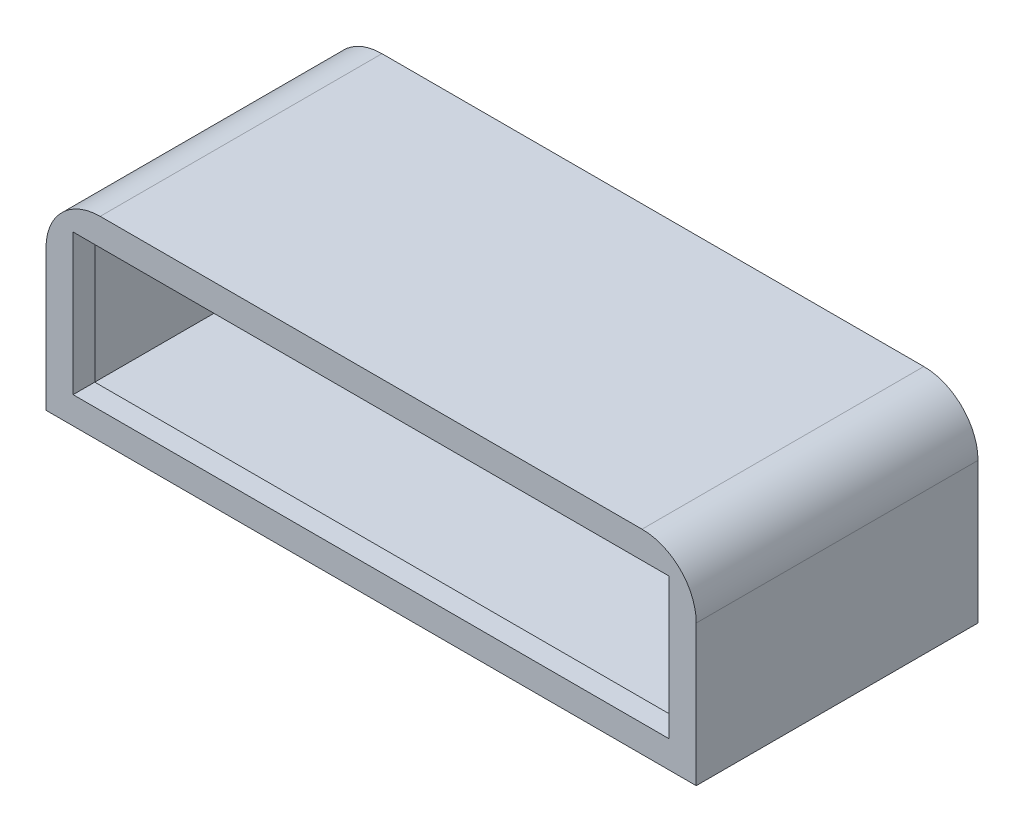
ISO-10303-21;
HEADER;
FILE_DESCRIPTION(('STEP AP214'),'2;1');
FILE_NAME('part.step','',(''),(''),'','','');
FILE_SCHEMA(('AUTOMOTIVE_DESIGN { 1 0 10303 214 1 1 1 1 }'));
ENDSEC;
DATA;
#1=APPLICATION_CONTEXT('core data for automotive mechanical design processes');
#2=APPLICATION_PROTOCOL_DEFINITION('international standard','automotive_design',2000,#1);
#3=PRODUCT_CONTEXT('',#1,'mechanical');
#4=PRODUCT('Part','Part','',(#3));
#5=PRODUCT_RELATED_PRODUCT_CATEGORY('part','',(#4));
#6=PRODUCT_DEFINITION_FORMATION('','',#4);
#7=PRODUCT_DEFINITION_CONTEXT('part definition',#1,'design');
#8=PRODUCT_DEFINITION('design','',#6,#7);
#9=PRODUCT_DEFINITION_SHAPE('','',#8);
#10=(LENGTH_UNIT() NAMED_UNIT(*) SI_UNIT(.MILLI.,.METRE.));
#11=(NAMED_UNIT(*) PLANE_ANGLE_UNIT() SI_UNIT($,.RADIAN.));
#12=(NAMED_UNIT(*) SI_UNIT($,.STERADIAN.) SOLID_ANGLE_UNIT());
#13=UNCERTAINTY_MEASURE_WITH_UNIT(LENGTH_MEASURE(1.E-05),#10,'distance_accuracy_value','');
#14=(GEOMETRIC_REPRESENTATION_CONTEXT(3) GLOBAL_UNCERTAINTY_ASSIGNED_CONTEXT((#13)) GLOBAL_UNIT_ASSIGNED_CONTEXT((#10,
#11,#12)) REPRESENTATION_CONTEXT('',''));
#15=CARTESIAN_POINT('',(0.,0.,0.));
#16=DIRECTION('',(0.,0.,1.));
#17=DIRECTION('',(1.,0.,0.));
#18=AXIS2_PLACEMENT_3D('',#15,#16,#17);
#19=CARTESIAN_POINT('',(0.,0.,0.));
#20=DIRECTION('',(0.,0.,-1.));
#21=DIRECTION('',(-1.,0.,0.));
#22=AXIS2_PLACEMENT_3D('',#19,#20,#21);
#23=PLANE('',#22);
#24=CARTESIAN_POINT('',(-57.15,-20.32,0.));
#25=DIRECTION('',(0.,0.,-1.));
#26=DIRECTION('',(1.,0.,0.));
#27=AXIS2_PLACEMENT_3D('',#24,#25,#26);
#28=CIRCLE('',#27,0.999999999999998);
#29=CARTESIAN_POINT('',(-56.15,-20.32,0.));
#30=VERTEX_POINT('',#29);
#31=EDGE_CURVE('E473',#30,#30,#28,.T.);
#32=ORIENTED_EDGE('',*,*,#31,.F.);
#33=EDGE_LOOP('',(#32));
#34=FACE_BOUND('',#33,.T.);
#35=CARTESIAN_POINT('',(-57.15,20.32,0.));
#36=DIRECTION('',(0.,0.,-1.));
#37=DIRECTION('',(-1.,0.,0.));
#38=AXIS2_PLACEMENT_3D('',#35,#36,#37);
#39=CIRCLE('',#38,0.999999999999998);
#40=CARTESIAN_POINT('',(-58.15,20.32,0.));
#41=VERTEX_POINT('',#40);
#42=EDGE_CURVE('E472',#41,#41,#39,.T.);
#43=ORIENTED_EDGE('',*,*,#42,.F.);
#44=EDGE_LOOP('',(#43));
#45=FACE_BOUND('',#44,.T.);
#46=CARTESIAN_POINT('',(57.15,20.32,0.));
#47=DIRECTION('',(0.,0.,-1.));
#48=DIRECTION('',(1.,0.,0.));
#49=AXIS2_PLACEMENT_3D('',#46,#47,#48);
#50=CIRCLE('',#49,0.999999999999998);
#51=CARTESIAN_POINT('',(58.15,20.32,0.));
#52=VERTEX_POINT('',#51);
#53=EDGE_CURVE('E504',#52,#52,#50,.T.);
#54=ORIENTED_EDGE('',*,*,#53,.F.);
#55=EDGE_LOOP('',(#54));
#56=FACE_BOUND('',#55,.T.);
#57=CARTESIAN_POINT('',(57.15,-20.32,0.));
#58=DIRECTION('',(0.,0.,-1.));
#59=DIRECTION('',(-1.,0.,0.));
#60=AXIS2_PLACEMENT_3D('',#57,#58,#59);
#61=CIRCLE('',#60,0.999999999999998);
#62=CARTESIAN_POINT('',(56.15,-20.32,0.));
#63=VERTEX_POINT('',#62);
#64=EDGE_CURVE('E485',#63,#63,#61,.T.);
#65=ORIENTED_EDGE('',*,*,#64,.F.);
#66=EDGE_LOOP('',(#65));
#67=FACE_BOUND('',#66,.T.);
#68=DIRECTION('',(-1.,0.,0.));
#69=VECTOR('',#68,1.);
#70=CARTESIAN_POINT('',(-76.2,22.86,0.));
#71=LINE('',#70,#69);
#72=CARTESIAN_POINT('',(63.5,22.86,0.));
#73=VERTEX_POINT('',#72);
#74=CARTESIAN_POINT('',(-63.5,22.86,0.));
#75=VERTEX_POINT('',#74);
#76=EDGE_CURVE('E216',#73,#75,#71,.T.);
#77=ORIENTED_EDGE('',*,*,#76,.F.);
#78=CARTESIAN_POINT('',(63.5,10.16,0.));
#79=DIRECTION('',(0.,0.,-1.));
#80=DIRECTION('',(-1.,0.,0.));
#81=AXIS2_PLACEMENT_3D('',#78,#79,#80);
#82=CIRCLE('',#81,12.7);
#83=CARTESIAN_POINT('',(76.2,10.16,0.));
#84=VERTEX_POINT('',#83);
#85=EDGE_CURVE('E241',#73,#84,#82,.T.);
#86=ORIENTED_EDGE('',*,*,#85,.T.);
#87=DIRECTION('',(0.,1.,0.));
#88=VECTOR('',#87,1.);
#89=CARTESIAN_POINT('',(76.2,-22.86,0.));
#90=LINE('',#89,#88);
#91=CARTESIAN_POINT('',(76.2,-22.86,0.));
#92=VERTEX_POINT('',#91);
#93=EDGE_CURVE('E177',#92,#84,#90,.T.);
#94=ORIENTED_EDGE('',*,*,#93,.F.);
#95=DIRECTION('',(1.,0.,0.));
#96=VECTOR('',#95,1.);
#97=CARTESIAN_POINT('',(-76.2,-22.86,0.));
#98=LINE('',#97,#96);
#99=CARTESIAN_POINT('',(-76.2,-22.86,0.));
#100=VERTEX_POINT('',#99);
#101=EDGE_CURVE('E208',#100,#92,#98,.T.);
#102=ORIENTED_EDGE('',*,*,#101,.F.);
#103=DIRECTION('',(0.,-1.,0.));
#104=VECTOR('',#103,1.);
#105=CARTESIAN_POINT('',(-76.2,-22.86,0.));
#106=LINE('',#105,#104);
#107=CARTESIAN_POINT('',(-76.2,10.16,0.));
#108=VERTEX_POINT('',#107);
#109=EDGE_CURVE('E219',#108,#100,#106,.T.);
#110=ORIENTED_EDGE('',*,*,#109,.F.);
#111=CARTESIAN_POINT('',(-63.5,10.16,0.));
#112=DIRECTION('',(0.,0.,-1.));
#113=DIRECTION('',(-1.,0.,0.));
#114=AXIS2_PLACEMENT_3D('',#111,#112,#113);
#115=CIRCLE('',#114,12.7);
#116=EDGE_CURVE('E239',#108,#75,#115,.T.);
#117=ORIENTED_EDGE('',*,*,#116,.T.);
#118=EDGE_LOOP('',(#77,#86,#94,#102,#110,#117));
#119=FACE_BOUND('',#118,.T.);
#120=DIRECTION('',(1.,0.,0.));
#121=VECTOR('',#120,1.);
#122=CARTESIAN_POINT('',(0.,-17.78,0.));
#123=LINE('',#122,#121);
#124=CARTESIAN_POINT('',(-71.12,-17.78,0.));
#125=VERTEX_POINT('',#124);
#126=CARTESIAN_POINT('',(71.12,-17.78,0.));
#127=VERTEX_POINT('',#126);
#128=EDGE_CURVE('E183',#125,#127,#123,.T.);
#129=ORIENTED_EDGE('',*,*,#128,.T.);
#130=DIRECTION('',(0.,1.,0.));
#131=VECTOR('',#130,1.);
#132=CARTESIAN_POINT('',(71.12,0.,0.));
#133=LINE('',#132,#131);
#134=CARTESIAN_POINT('',(71.12,17.78,0.));
#135=VERTEX_POINT('',#134);
#136=EDGE_CURVE('E171',#127,#135,#133,.T.);
#137=ORIENTED_EDGE('',*,*,#136,.T.);
#138=DIRECTION('',(-1.,0.,0.));
#139=VECTOR('',#138,1.);
#140=CARTESIAN_POINT('',(0.,17.78,0.));
#141=LINE('',#140,#139);
#142=CARTESIAN_POINT('',(-71.12,17.78,0.));
#143=VERTEX_POINT('',#142);
#144=EDGE_CURVE('E197',#135,#143,#141,.T.);
#145=ORIENTED_EDGE('',*,*,#144,.T.);
#146=DIRECTION('',(0.,-1.,0.));
#147=VECTOR('',#146,1.);
#148=CARTESIAN_POINT('',(-71.12,0.,0.));
#149=LINE('',#148,#147);
#150=EDGE_CURVE('E200',#143,#125,#149,.T.);
#151=ORIENTED_EDGE('',*,*,#150,.T.);
#152=EDGE_LOOP('',(#129,#137,#145,#151));
#153=FACE_BOUND('',#152,.T.);
#154=ADVANCED_FACE('F35',(#34,#45,#56,#67,#119,#153),#23,.T.);
#155=CARTESIAN_POINT('',(76.2,-22.86,66.04));
#156=DIRECTION('',(-1.,0.,0.));
#157=DIRECTION('',(0.,0.,1.));
#158=AXIS2_PLACEMENT_3D('',#155,#156,#157);
#159=PLANE('',#158);
#160=ORIENTED_EDGE('',*,*,#93,.T.);
#161=DIRECTION('',(0.,0.,-1.));
#162=VECTOR('',#161,1.);
#163=CARTESIAN_POINT('',(76.2,10.16,66.04));
#164=LINE('',#163,#162);
#165=CARTESIAN_POINT('',(76.2,10.16,66.04));
#166=VERTEX_POINT('',#165);
#167=EDGE_CURVE('E58',#84,#166,#164,.F.);
#168=ORIENTED_EDGE('',*,*,#167,.T.);
#169=DIRECTION('',(0.,1.,0.));
#170=VECTOR('',#169,1.);
#171=CARTESIAN_POINT('',(76.2,-22.86,66.04));
#172=LINE('',#171,#170);
#173=CARTESIAN_POINT('',(76.2,-22.86,66.04));
#174=VERTEX_POINT('',#173);
#175=EDGE_CURVE('E205',#174,#166,#172,.T.);
#176=ORIENTED_EDGE('',*,*,#175,.F.);
#177=DIRECTION('',(0.,0.,-1.));
#178=VECTOR('',#177,1.);
#179=CARTESIAN_POINT('',(76.2,-22.86,66.04));
#180=LINE('',#179,#178);
#181=EDGE_CURVE('E214',#174,#92,#180,.T.);
#182=ORIENTED_EDGE('',*,*,#181,.T.);
#183=EDGE_LOOP('',(#160,#168,#176,#182));
#184=FACE_BOUND('',#183,.T.);
#185=ADVANCED_FACE('F257',(#184),#159,.F.);
#186=CARTESIAN_POINT('',(-76.2,22.86,66.04));
#187=DIRECTION('',(0.,-1.,0.));
#188=DIRECTION('',(0.,0.,-1.));
#189=AXIS2_PLACEMENT_3D('',#186,#187,#188);
#190=PLANE('',#189);
#191=DIRECTION('',(-1.,0.,0.));
#192=VECTOR('',#191,1.);
#193=CARTESIAN_POINT('',(-76.2,22.86,66.04));
#194=LINE('',#193,#192);
#195=CARTESIAN_POINT('',(63.5,22.86,66.04));
#196=VERTEX_POINT('',#195);
#197=CARTESIAN_POINT('',(-63.5,22.86,66.04));
#198=VERTEX_POINT('',#197);
#199=EDGE_CURVE('E207',#196,#198,#194,.T.);
#200=ORIENTED_EDGE('',*,*,#199,.F.);
#201=DIRECTION('',(0.,0.,-1.));
#202=VECTOR('',#201,1.);
#203=CARTESIAN_POINT('',(63.5,22.86,66.04));
#204=LINE('',#203,#202);
#205=EDGE_CURVE('E236',#196,#73,#204,.T.);
#206=ORIENTED_EDGE('',*,*,#205,.T.);
#207=ORIENTED_EDGE('',*,*,#76,.T.);
#208=DIRECTION('',(0.,0.,-1.));
#209=VECTOR('',#208,1.);
#210=CARTESIAN_POINT('',(-63.5,22.86,66.04));
#211=LINE('',#210,#209);
#212=EDGE_CURVE('E234',#75,#198,#211,.F.);
#213=ORIENTED_EDGE('',*,*,#212,.T.);
#214=EDGE_LOOP('',(#200,#206,#207,#213));
#215=FACE_BOUND('',#214,.T.);
#216=ADVANCED_FACE('F249',(#215),#190,.F.);
#217=CARTESIAN_POINT('',(-76.2,-22.86,66.04));
#218=DIRECTION('',(1.,0.,0.));
#219=DIRECTION('',(0.,0.,-1.));
#220=AXIS2_PLACEMENT_3D('',#217,#218,#219);
#221=PLANE('',#220);
#222=DIRECTION('',(0.,-1.,0.));
#223=VECTOR('',#222,1.);
#224=CARTESIAN_POINT('',(-76.2,-22.86,66.04));
#225=LINE('',#224,#223);
#226=CARTESIAN_POINT('',(-76.2,10.16,66.04));
#227=VERTEX_POINT('',#226);
#228=CARTESIAN_POINT('',(-76.2,-22.86,66.04));
#229=VERTEX_POINT('',#228);
#230=EDGE_CURVE('E210',#227,#229,#225,.T.);
#231=ORIENTED_EDGE('',*,*,#230,.F.);
#232=DIRECTION('',(0.,0.,-1.));
#233=VECTOR('',#232,1.);
#234=CARTESIAN_POINT('',(-76.2,10.16,66.04));
#235=LINE('',#234,#233);
#236=EDGE_CURVE('E11',#227,#108,#235,.T.);
#237=ORIENTED_EDGE('',*,*,#236,.T.);
#238=ORIENTED_EDGE('',*,*,#109,.T.);
#239=DIRECTION('',(0.,0.,-1.));
#240=VECTOR('',#239,1.);
#241=CARTESIAN_POINT('',(-76.2,-22.86,66.04));
#242=LINE('',#241,#240);
#243=EDGE_CURVE('E224',#229,#100,#242,.T.);
#244=ORIENTED_EDGE('',*,*,#243,.F.);
#245=EDGE_LOOP('',(#231,#237,#238,#244));
#246=FACE_BOUND('',#245,.T.);
#247=ADVANCED_FACE('F265',(#246),#221,.F.);
#248=CARTESIAN_POINT('',(-76.2,-22.86,66.04));
#249=DIRECTION('',(0.,1.,0.));
#250=DIRECTION('',(0.,0.,1.));
#251=AXIS2_PLACEMENT_3D('',#248,#249,#250);
#252=PLANE('',#251);
#253=ORIENTED_EDGE('',*,*,#101,.T.);
#254=ORIENTED_EDGE('',*,*,#181,.F.);
#255=DIRECTION('',(1.,0.,0.));
#256=VECTOR('',#255,1.);
#257=CARTESIAN_POINT('',(-76.2,-22.86,66.04));
#258=LINE('',#257,#256);
#259=EDGE_CURVE('E212',#229,#174,#258,.T.);
#260=ORIENTED_EDGE('',*,*,#259,.F.);
#261=ORIENTED_EDGE('',*,*,#243,.T.);
#262=EDGE_LOOP('',(#253,#254,#260,#261));
#263=FACE_BOUND('',#262,.T.);
#264=ADVANCED_FACE('F261',(#263),#252,.F.);
#265=CARTESIAN_POINT('',(0.,0.,66.04));
#266=DIRECTION('',(0.,0.,-1.));
#267=DIRECTION('',(-1.,0.,0.));
#268=AXIS2_PLACEMENT_3D('',#265,#266,#267);
#269=PLANE('',#268);
#270=DIRECTION('',(-1.,0.,0.));
#271=VECTOR('',#270,1.);
#272=CARTESIAN_POINT('',(-69.85,16.51,66.04));
#273=LINE('',#272,#271);
#274=CARTESIAN_POINT('',(69.85,16.51,66.04));
#275=VERTEX_POINT('',#274);
#276=CARTESIAN_POINT('',(-69.85,16.51,66.04));
#277=VERTEX_POINT('',#276);
#278=EDGE_CURVE('E155',#275,#277,#273,.T.);
#279=ORIENTED_EDGE('',*,*,#278,.F.);
#280=DIRECTION('',(0.,1.,0.));
#281=VECTOR('',#280,1.);
#282=CARTESIAN_POINT('',(69.85,-16.51,66.04));
#283=LINE('',#282,#281);
#284=CARTESIAN_POINT('',(69.85,-16.51,66.04));
#285=VERTEX_POINT('',#284);
#286=EDGE_CURVE('E160',#285,#275,#283,.T.);
#287=ORIENTED_EDGE('',*,*,#286,.F.);
#288=DIRECTION('',(1.,0.,0.));
#289=VECTOR('',#288,1.);
#290=CARTESIAN_POINT('',(-69.85,-16.51,66.04));
#291=LINE('',#290,#289);
#292=CARTESIAN_POINT('',(-69.85,-16.51,66.04));
#293=VERTEX_POINT('',#292);
#294=EDGE_CURVE('E164',#293,#285,#291,.T.);
#295=ORIENTED_EDGE('',*,*,#294,.F.);
#296=DIRECTION('',(0.,-1.,0.));
#297=VECTOR('',#296,1.);
#298=CARTESIAN_POINT('',(-69.85,-16.51,66.04));
#299=LINE('',#298,#297);
#300=EDGE_CURVE('E144',#277,#293,#299,.T.);
#301=ORIENTED_EDGE('',*,*,#300,.F.);
#302=EDGE_LOOP('',(#279,#287,#295,#301));
#303=FACE_BOUND('',#302,.T.);
#304=ORIENTED_EDGE('',*,*,#175,.T.);
#305=CARTESIAN_POINT('',(63.5,10.16,66.04));
#306=DIRECTION('',(0.,0.,-1.));
#307=DIRECTION('',(-1.,0.,0.));
#308=AXIS2_PLACEMENT_3D('',#305,#306,#307);
#309=CIRCLE('',#308,12.7);
#310=EDGE_CURVE('E43',#166,#196,#309,.F.);
#311=ORIENTED_EDGE('',*,*,#310,.T.);
#312=ORIENTED_EDGE('',*,*,#199,.T.);
#313=CARTESIAN_POINT('',(-63.5,10.16,66.04));
#314=DIRECTION('',(0.,0.,-1.));
#315=DIRECTION('',(-1.,0.,0.));
#316=AXIS2_PLACEMENT_3D('',#313,#314,#315);
#317=CIRCLE('',#316,12.7);
#318=EDGE_CURVE('E50',#198,#227,#317,.F.);
#319=ORIENTED_EDGE('',*,*,#318,.T.);
#320=ORIENTED_EDGE('',*,*,#230,.T.);
#321=ORIENTED_EDGE('',*,*,#259,.T.);
#322=EDGE_LOOP('',(#304,#311,#312,#319,#320,#321));
#323=FACE_BOUND('',#322,.T.);
#324=ADVANCED_FACE('F162',(#303,#323),#269,.F.);
#325=CARTESIAN_POINT('',(71.12,-22.86,66.04));
#326=DIRECTION('',(-1.,0.,0.));
#327=DIRECTION('',(0.,0.,1.));
#328=AXIS2_PLACEMENT_3D('',#325,#326,#327);
#329=PLANE('',#328);
#330=ORIENTED_EDGE('',*,*,#136,.F.);
#331=DIRECTION('',(0.,0.,-1.));
#332=VECTOR('',#331,1.);
#333=CARTESIAN_POINT('',(71.12,-17.78,66.04));
#334=LINE('',#333,#332);
#335=CARTESIAN_POINT('',(71.12,-17.78,60.96));
#336=VERTEX_POINT('',#335);
#337=EDGE_CURVE('E184',#336,#127,#334,.T.);
#338=ORIENTED_EDGE('',*,*,#337,.F.);
#339=DIRECTION('',(0.,1.,0.));
#340=VECTOR('',#339,1.);
#341=CARTESIAN_POINT('',(71.12,0.,60.96));
#342=LINE('',#341,#340);
#343=CARTESIAN_POINT('',(71.12,17.78,60.96));
#344=VERTEX_POINT('',#343);
#345=EDGE_CURVE('E179',#336,#344,#342,.T.);
#346=ORIENTED_EDGE('',*,*,#345,.T.);
#347=DIRECTION('',(0.,0.,-1.));
#348=VECTOR('',#347,1.);
#349=CARTESIAN_POINT('',(71.12,17.78,66.04));
#350=LINE('',#349,#348);
#351=EDGE_CURVE('E174',#344,#135,#350,.T.);
#352=ORIENTED_EDGE('',*,*,#351,.T.);
#353=EDGE_LOOP('',(#330,#338,#346,#352));
#354=FACE_BOUND('',#353,.T.);
#355=ADVANCED_FACE('F313',(#354),#329,.T.);
#356=CARTESIAN_POINT('',(-76.2,17.78,66.04));
#357=DIRECTION('',(0.,-1.,0.));
#358=DIRECTION('',(0.,0.,-1.));
#359=AXIS2_PLACEMENT_3D('',#356,#357,#358);
#360=PLANE('',#359);
#361=ORIENTED_EDGE('',*,*,#144,.F.);
#362=ORIENTED_EDGE('',*,*,#351,.F.);
#363=DIRECTION('',(-1.,0.,0.));
#364=VECTOR('',#363,1.);
#365=CARTESIAN_POINT('',(0.,17.78,60.96));
#366=LINE('',#365,#364);
#367=CARTESIAN_POINT('',(-71.12,17.78,60.96));
#368=VERTEX_POINT('',#367);
#369=EDGE_CURVE('E182',#344,#368,#366,.T.);
#370=ORIENTED_EDGE('',*,*,#369,.T.);
#371=DIRECTION('',(0.,0.,-1.));
#372=VECTOR('',#371,1.);
#373=CARTESIAN_POINT('',(-71.12,17.78,66.04));
#374=LINE('',#373,#372);
#375=EDGE_CURVE('E178',#368,#143,#374,.T.);
#376=ORIENTED_EDGE('',*,*,#375,.T.);
#377=EDGE_LOOP('',(#361,#362,#370,#376));
#378=FACE_BOUND('',#377,.T.);
#379=ADVANCED_FACE('F319',(#378),#360,.T.);
#380=CARTESIAN_POINT('',(-71.12,-22.86,66.04));
#381=DIRECTION('',(1.,0.,0.));
#382=DIRECTION('',(0.,0.,-1.));
#383=AXIS2_PLACEMENT_3D('',#380,#381,#382);
#384=PLANE('',#383);
#385=ORIENTED_EDGE('',*,*,#150,.F.);
#386=ORIENTED_EDGE('',*,*,#375,.F.);
#387=DIRECTION('',(0.,-1.,0.));
#388=VECTOR('',#387,1.);
#389=CARTESIAN_POINT('',(-71.12,0.,60.96));
#390=LINE('',#389,#388);
#391=CARTESIAN_POINT('',(-71.12,-17.78,60.96));
#392=VERTEX_POINT('',#391);
#393=EDGE_CURVE('E191',#368,#392,#390,.T.);
#394=ORIENTED_EDGE('',*,*,#393,.T.);
#395=DIRECTION('',(0.,0.,-1.));
#396=VECTOR('',#395,1.);
#397=CARTESIAN_POINT('',(-71.12,-17.78,66.04));
#398=LINE('',#397,#396);
#399=EDGE_CURVE('E186',#392,#125,#398,.T.);
#400=ORIENTED_EDGE('',*,*,#399,.T.);
#401=EDGE_LOOP('',(#385,#386,#394,#400));
#402=FACE_BOUND('',#401,.T.);
#403=ADVANCED_FACE('F327',(#402),#384,.T.);
#404=CARTESIAN_POINT('',(-76.2,-17.78,66.04));
#405=DIRECTION('',(0.,1.,0.));
#406=DIRECTION('',(0.,0.,1.));
#407=AXIS2_PLACEMENT_3D('',#404,#405,#406);
#408=PLANE('',#407);
#409=ORIENTED_EDGE('',*,*,#128,.F.);
#410=ORIENTED_EDGE('',*,*,#399,.F.);
#411=DIRECTION('',(1.,0.,0.));
#412=VECTOR('',#411,1.);
#413=CARTESIAN_POINT('',(0.,-17.78,60.96));
#414=LINE('',#413,#412);
#415=EDGE_CURVE('E187',#392,#336,#414,.T.);
#416=ORIENTED_EDGE('',*,*,#415,.T.);
#417=ORIENTED_EDGE('',*,*,#337,.T.);
#418=EDGE_LOOP('',(#409,#410,#416,#417));
#419=FACE_BOUND('',#418,.T.);
#420=ADVANCED_FACE('F335',(#419),#408,.T.);
#421=CARTESIAN_POINT('',(0.,0.,60.96));
#422=DIRECTION('',(0.,0.,-1.));
#423=DIRECTION('',(-1.,0.,0.));
#424=AXIS2_PLACEMENT_3D('',#421,#422,#423);
#425=PLANE('',#424);
#426=DIRECTION('',(0.,-1.,0.));
#427=VECTOR('',#426,1.);
#428=CARTESIAN_POINT('',(69.85,0.,60.96));
#429=LINE('',#428,#427);
#430=CARTESIAN_POINT('',(69.85,16.51,60.96));
#431=VERTEX_POINT('',#430);
#432=CARTESIAN_POINT('',(69.85,-16.51,60.96));
#433=VERTEX_POINT('',#432);
#434=EDGE_CURVE('E232',#431,#433,#429,.T.);
#435=ORIENTED_EDGE('',*,*,#434,.F.);
#436=DIRECTION('',(1.,0.,0.));
#437=VECTOR('',#436,1.);
#438=CARTESIAN_POINT('',(0.,16.51,60.96));
#439=LINE('',#438,#437);
#440=CARTESIAN_POINT('',(-69.85,16.51,60.96));
#441=VERTEX_POINT('',#440);
#442=EDGE_CURVE('E227',#441,#431,#439,.T.);
#443=ORIENTED_EDGE('',*,*,#442,.F.);
#444=DIRECTION('',(0.,1.,0.));
#445=VECTOR('',#444,1.);
#446=CARTESIAN_POINT('',(-69.85,0.,60.96));
#447=LINE('',#446,#445);
#448=CARTESIAN_POINT('',(-69.85,-16.51,60.96));
#449=VERTEX_POINT('',#448);
#450=EDGE_CURVE('E147',#449,#441,#447,.T.);
#451=ORIENTED_EDGE('',*,*,#450,.F.);
#452=DIRECTION('',(-1.,0.,0.));
#453=VECTOR('',#452,1.);
#454=CARTESIAN_POINT('',(0.,-16.51,60.96));
#455=LINE('',#454,#453);
#456=EDGE_CURVE('E230',#433,#449,#455,.T.);
#457=ORIENTED_EDGE('',*,*,#456,.F.);
#458=EDGE_LOOP('',(#435,#443,#451,#457));
#459=FACE_BOUND('',#458,.T.);
#460=ORIENTED_EDGE('',*,*,#345,.F.);
#461=ORIENTED_EDGE('',*,*,#415,.F.);
#462=ORIENTED_EDGE('',*,*,#393,.F.);
#463=ORIENTED_EDGE('',*,*,#369,.F.);
#464=EDGE_LOOP('',(#460,#461,#462,#463));
#465=FACE_BOUND('',#464,.T.);
#466=ADVANCED_FACE('F343',(#459,#465),#425,.T.);
#467=CARTESIAN_POINT('',(69.85,-16.51,52.578));
#468=DIRECTION('',(1.,0.,0.));
#469=DIRECTION('',(0.,0.,-1.));
#470=AXIS2_PLACEMENT_3D('',#467,#468,#469);
#471=PLANE('',#470);
#472=ORIENTED_EDGE('',*,*,#434,.T.);
#473=DIRECTION('',(0.,0.,1.));
#474=VECTOR('',#473,1.);
#475=CARTESIAN_POINT('',(69.85,-16.51,52.578));
#476=LINE('',#475,#474);
#477=EDGE_CURVE('E169',#433,#285,#476,.T.);
#478=ORIENTED_EDGE('',*,*,#477,.T.);
#479=ORIENTED_EDGE('',*,*,#286,.T.);
#480=DIRECTION('',(0.,0.,1.));
#481=VECTOR('',#480,1.);
#482=CARTESIAN_POINT('',(69.85,16.51,52.578));
#483=LINE('',#482,#481);
#484=EDGE_CURVE('E151',#431,#275,#483,.T.);
#485=ORIENTED_EDGE('',*,*,#484,.F.);
#486=EDGE_LOOP('',(#472,#478,#479,#485));
#487=FACE_BOUND('',#486,.T.);
#488=ADVANCED_FACE('F351',(#487),#471,.F.);
#489=CARTESIAN_POINT('',(-69.85,-16.51,52.578));
#490=DIRECTION('',(0.,-1.,0.));
#491=DIRECTION('',(0.,0.,-1.));
#492=AXIS2_PLACEMENT_3D('',#489,#490,#491);
#493=PLANE('',#492);
#494=ORIENTED_EDGE('',*,*,#456,.T.);
#495=DIRECTION('',(0.,0.,1.));
#496=VECTOR('',#495,1.);
#497=CARTESIAN_POINT('',(-69.85,-16.51,52.578));
#498=LINE('',#497,#496);
#499=EDGE_CURVE('E150',#449,#293,#498,.T.);
#500=ORIENTED_EDGE('',*,*,#499,.T.);
#501=ORIENTED_EDGE('',*,*,#294,.T.);
#502=ORIENTED_EDGE('',*,*,#477,.F.);
#503=EDGE_LOOP('',(#494,#500,#501,#502));
#504=FACE_BOUND('',#503,.T.);
#505=ADVANCED_FACE('F358',(#504),#493,.F.);
#506=CARTESIAN_POINT('',(-69.85,-16.51,52.578));
#507=DIRECTION('',(-1.,0.,0.));
#508=DIRECTION('',(0.,0.,1.));
#509=AXIS2_PLACEMENT_3D('',#506,#507,#508);
#510=PLANE('',#509);
#511=ORIENTED_EDGE('',*,*,#450,.T.);
#512=DIRECTION('',(0.,0.,1.));
#513=VECTOR('',#512,1.);
#514=CARTESIAN_POINT('',(-69.85,16.51,52.578));
#515=LINE('',#514,#513);
#516=EDGE_CURVE('E139',#441,#277,#515,.T.);
#517=ORIENTED_EDGE('',*,*,#516,.T.);
#518=ORIENTED_EDGE('',*,*,#300,.T.);
#519=ORIENTED_EDGE('',*,*,#499,.F.);
#520=EDGE_LOOP('',(#511,#517,#518,#519));
#521=FACE_BOUND('',#520,.T.);
#522=ADVANCED_FACE('F141',(#521),#510,.F.);
#523=CARTESIAN_POINT('',(-69.85,16.51,52.578));
#524=DIRECTION('',(0.,1.,0.));
#525=DIRECTION('',(0.,0.,1.));
#526=AXIS2_PLACEMENT_3D('',#523,#524,#525);
#527=PLANE('',#526);
#528=ORIENTED_EDGE('',*,*,#442,.T.);
#529=ORIENTED_EDGE('',*,*,#484,.T.);
#530=ORIENTED_EDGE('',*,*,#278,.T.);
#531=ORIENTED_EDGE('',*,*,#516,.F.);
#532=EDGE_LOOP('',(#528,#529,#530,#531));
#533=FACE_BOUND('',#532,.T.);
#534=ADVANCED_FACE('F156',(#533),#527,.F.);
#535=CARTESIAN_POINT('',(63.5,10.16,66.04));
#536=DIRECTION('',(0.,0.,-1.));
#537=DIRECTION('',(-1.,0.,0.));
#538=AXIS2_PLACEMENT_3D('',#535,#536,#537);
#539=CYLINDRICAL_SURFACE('',#538,12.7);
#540=ORIENTED_EDGE('',*,*,#310,.F.);
#541=ORIENTED_EDGE('',*,*,#167,.F.);
#542=ORIENTED_EDGE('',*,*,#85,.F.);
#543=ORIENTED_EDGE('',*,*,#205,.F.);
#544=EDGE_LOOP('',(#540,#541,#542,#543));
#545=FACE_BOUND('',#544,.T.);
#546=ADVANCED_FACE('F252',(#545),#539,.T.);
#547=CARTESIAN_POINT('',(-63.5,10.16,66.04));
#548=DIRECTION('',(0.,0.,-1.));
#549=DIRECTION('',(-1.,0.,0.));
#550=AXIS2_PLACEMENT_3D('',#547,#548,#549);
#551=CYLINDRICAL_SURFACE('',#550,12.7);
#552=ORIENTED_EDGE('',*,*,#318,.F.);
#553=ORIENTED_EDGE('',*,*,#212,.F.);
#554=ORIENTED_EDGE('',*,*,#116,.F.);
#555=ORIENTED_EDGE('',*,*,#236,.F.);
#556=EDGE_LOOP('',(#552,#553,#554,#555));
#557=FACE_BOUND('',#556,.T.);
#558=ADVANCED_FACE('F37',(#557),#551,.T.);
#559=CARTESIAN_POINT('',(57.15,-20.32,3.175));
#560=DIRECTION('',(0.,0.,-1.));
#561=DIRECTION('',(-1.,0.,0.));
#562=AXIS2_PLACEMENT_3D('',#559,#560,#561);
#563=CYLINDRICAL_SURFACE('',#562,0.999999999999998);
#564=CARTESIAN_POINT('',(57.15,-20.32,3.175));
#565=DIRECTION('',(0.,0.,-1.));
#566=DIRECTION('',(-1.,0.,0.));
#567=AXIS2_PLACEMENT_3D('',#564,#565,#566);
#568=CIRCLE('',#567,0.999999999999998);
#569=CARTESIAN_POINT('',(56.15,-20.32,3.175));
#570=VERTEX_POINT('',#569);
#571=EDGE_CURVE('E482',#570,#570,#568,.T.);
#572=ORIENTED_EDGE('',*,*,#571,.F.);
#573=EDGE_LOOP('',(#572));
#574=FACE_BOUND('',#573,.T.);
#575=ORIENTED_EDGE('',*,*,#64,.T.);
#576=EDGE_LOOP('',(#575));
#577=FACE_BOUND('',#576,.T.);
#578=ADVANCED_FACE('F269',(#574,#577),#563,.F.);
#579=CARTESIAN_POINT('',(57.15,-20.32,3.175));
#580=DIRECTION('',(0.,0.,-1.));
#581=DIRECTION('',(-1.,0.,0.));
#582=AXIS2_PLACEMENT_3D('',#579,#580,#581);
#583=PLANE('',#582);
#584=ORIENTED_EDGE('',*,*,#571,.T.);
#585=EDGE_LOOP('',(#584));
#586=FACE_BOUND('',#585,.T.);
#587=ADVANCED_FACE('F274',(#586),#583,.T.);
#588=CARTESIAN_POINT('',(57.15,20.32,3.175));
#589=DIRECTION('',(0.,0.,-1.));
#590=DIRECTION('',(-1.,0.,0.));
#591=AXIS2_PLACEMENT_3D('',#588,#589,#590);
#592=CYLINDRICAL_SURFACE('',#591,0.999999999999998);
#593=CARTESIAN_POINT('',(57.15,20.32,3.175));
#594=DIRECTION('',(0.,0.,-1.));
#595=DIRECTION('',(1.,0.,0.));
#596=AXIS2_PLACEMENT_3D('',#593,#594,#595);
#597=CIRCLE('',#596,0.999999999999998);
#598=CARTESIAN_POINT('',(58.15,20.32,3.175));
#599=VERTEX_POINT('',#598);
#600=EDGE_CURVE('E487',#599,#599,#597,.T.);
#601=ORIENTED_EDGE('',*,*,#600,.F.);
#602=EDGE_LOOP('',(#601));
#603=FACE_BOUND('',#602,.T.);
#604=ORIENTED_EDGE('',*,*,#53,.T.);
#605=EDGE_LOOP('',(#604));
#606=FACE_BOUND('',#605,.T.);
#607=ADVANCED_FACE('F405',(#603,#606),#592,.F.);
#608=CARTESIAN_POINT('',(57.15,20.32,3.175));
#609=DIRECTION('',(0.,0.,1.));
#610=DIRECTION('',(1.,0.,0.));
#611=AXIS2_PLACEMENT_3D('',#608,#609,#610);
#612=PLANE('',#611);
#613=ORIENTED_EDGE('',*,*,#600,.T.);
#614=EDGE_LOOP('',(#613));
#615=FACE_BOUND('',#614,.T.);
#616=ADVANCED_FACE('F415',(#615),#612,.F.);
#617=CARTESIAN_POINT('',(-57.15,20.32,3.175));
#618=DIRECTION('',(0.,0.,-1.));
#619=DIRECTION('',(-1.,0.,0.));
#620=AXIS2_PLACEMENT_3D('',#617,#618,#619);
#621=CYLINDRICAL_SURFACE('',#620,0.999999999999998);
#622=CARTESIAN_POINT('',(-57.15,20.32,3.175));
#623=DIRECTION('',(0.,0.,-1.));
#624=DIRECTION('',(-1.,0.,0.));
#625=AXIS2_PLACEMENT_3D('',#622,#623,#624);
#626=CIRCLE('',#625,0.999999999999998);
#627=CARTESIAN_POINT('',(-58.15,20.32,3.175));
#628=VERTEX_POINT('',#627);
#629=EDGE_CURVE('E476',#628,#628,#626,.T.);
#630=ORIENTED_EDGE('',*,*,#629,.F.);
#631=EDGE_LOOP('',(#630));
#632=FACE_BOUND('',#631,.T.);
#633=ORIENTED_EDGE('',*,*,#42,.T.);
#634=EDGE_LOOP('',(#633));
#635=FACE_BOUND('',#634,.T.);
#636=ADVANCED_FACE('F425',(#632,#635),#621,.F.);
#637=CARTESIAN_POINT('',(-57.15,20.32,3.175));
#638=DIRECTION('',(0.,0.,-1.));
#639=DIRECTION('',(-1.,0.,0.));
#640=AXIS2_PLACEMENT_3D('',#637,#638,#639);
#641=PLANE('',#640);
#642=ORIENTED_EDGE('',*,*,#629,.T.);
#643=EDGE_LOOP('',(#642));
#644=FACE_BOUND('',#643,.T.);
#645=ADVANCED_FACE('F435',(#644),#641,.T.);
#646=CARTESIAN_POINT('',(-57.15,-20.32,3.175));
#647=DIRECTION('',(0.,0.,-1.));
#648=DIRECTION('',(-1.,0.,0.));
#649=AXIS2_PLACEMENT_3D('',#646,#647,#648);
#650=CYLINDRICAL_SURFACE('',#649,0.999999999999998);
#651=CARTESIAN_POINT('',(-57.15,-20.32,3.175));
#652=DIRECTION('',(0.,0.,-1.));
#653=DIRECTION('',(1.,0.,0.));
#654=AXIS2_PLACEMENT_3D('',#651,#652,#653);
#655=CIRCLE('',#654,0.999999999999998);
#656=CARTESIAN_POINT('',(-56.15,-20.32,3.175));
#657=VERTEX_POINT('',#656);
#658=EDGE_CURVE('E471',#657,#657,#655,.T.);
#659=ORIENTED_EDGE('',*,*,#658,.F.);
#660=EDGE_LOOP('',(#659));
#661=FACE_BOUND('',#660,.T.);
#662=ORIENTED_EDGE('',*,*,#31,.T.);
#663=EDGE_LOOP('',(#662));
#664=FACE_BOUND('',#663,.T.);
#665=ADVANCED_FACE('F445',(#661,#664),#650,.F.);
#666=CARTESIAN_POINT('',(-57.15,-20.32,3.175));
#667=DIRECTION('',(0.,0.,1.));
#668=DIRECTION('',(1.,0.,0.));
#669=AXIS2_PLACEMENT_3D('',#666,#667,#668);
#670=PLANE('',#669);
#671=ORIENTED_EDGE('',*,*,#658,.T.);
#672=EDGE_LOOP('',(#671));
#673=FACE_BOUND('',#672,.T.);
#674=ADVANCED_FACE('F455',(#673),#670,.F.);
#675=CLOSED_SHELL('',(#154,#185,#216,#247,#264,#324,#355,#379,#403,#420,#466,#488,#505,#522,
#534,#546,#558,#578,#587,#607,#616,#636,#645,#665,#674));
#676=MANIFOLD_SOLID_BREP('B2',#675);
#677=ADVANCED_BREP_SHAPE_REPRESENTATION('',(#18,#676),#14);
#678=SHAPE_DEFINITION_REPRESENTATION(#9,#677);
ENDSEC;
END-ISO-10303-21;
